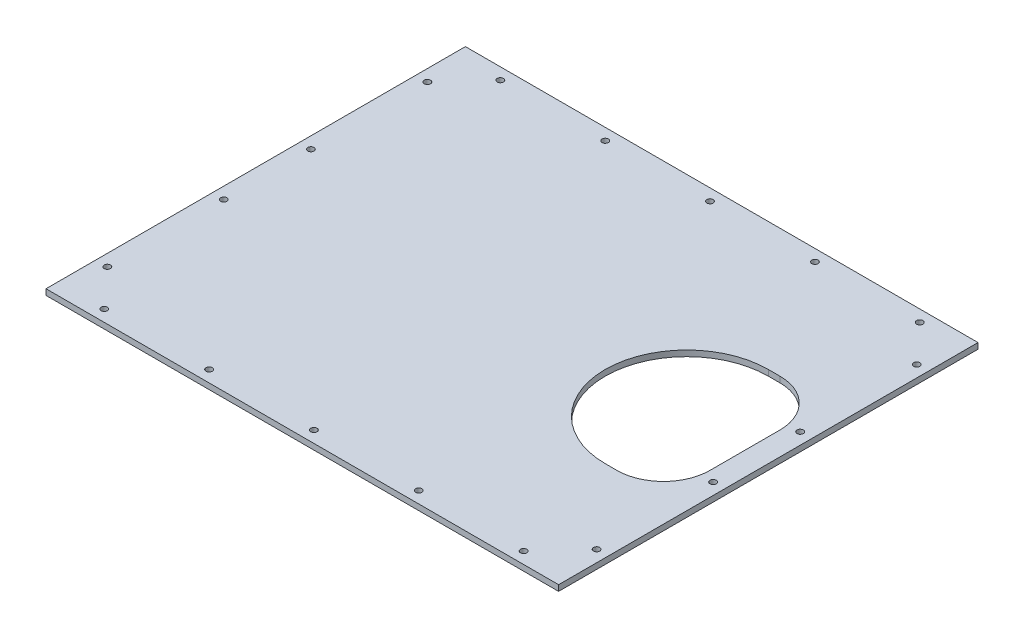
ISO-10303-21;
HEADER;
FILE_DESCRIPTION(('STEP AP214'),'2;1');
FILE_NAME('part.step','',(''),(''),'','','');
FILE_SCHEMA(('AUTOMOTIVE_DESIGN { 1 0 10303 214 1 1 1 1 }'));
ENDSEC;
DATA;
#1=APPLICATION_CONTEXT('core data for automotive mechanical design processes');
#2=APPLICATION_PROTOCOL_DEFINITION('international standard','automotive_design',2000,#1);
#3=PRODUCT_CONTEXT('',#1,'mechanical');
#4=PRODUCT('Part','Part','',(#3));
#5=PRODUCT_RELATED_PRODUCT_CATEGORY('part','',(#4));
#6=PRODUCT_DEFINITION_FORMATION('','',#4);
#7=PRODUCT_DEFINITION_CONTEXT('part definition',#1,'design');
#8=PRODUCT_DEFINITION('design','',#6,#7);
#9=PRODUCT_DEFINITION_SHAPE('','',#8);
#10=(LENGTH_UNIT() NAMED_UNIT(*) SI_UNIT(.MILLI.,.METRE.));
#11=(NAMED_UNIT(*) PLANE_ANGLE_UNIT() SI_UNIT($,.RADIAN.));
#12=(NAMED_UNIT(*) SI_UNIT($,.STERADIAN.) SOLID_ANGLE_UNIT());
#13=UNCERTAINTY_MEASURE_WITH_UNIT(LENGTH_MEASURE(1.E-05),#10,'distance_accuracy_value','');
#14=(GEOMETRIC_REPRESENTATION_CONTEXT(3) GLOBAL_UNCERTAINTY_ASSIGNED_CONTEXT((#13)) GLOBAL_UNIT_ASSIGNED_CONTEXT((#10,
#11,#12)) REPRESENTATION_CONTEXT('',''));
#15=CARTESIAN_POINT('',(0.,0.,0.));
#16=DIRECTION('',(0.,0.,1.));
#17=DIRECTION('',(1.,0.,0.));
#18=AXIS2_PLACEMENT_3D('',#15,#16,#17);
#19=CARTESIAN_POINT('',(0.,5.,0.));
#20=DIRECTION('',(0.,-1.,0.));
#21=DIRECTION('',(0.,0.,-1.));
#22=AXIS2_PLACEMENT_3D('',#19,#20,#21);
#23=PLANE('',#22);
#24=DIRECTION('',(0.,0.,1.));
#25=VECTOR('',#24,1.);
#26=CARTESIAN_POINT('',(0.,5.,0.));
#27=LINE('',#26,#25);
#28=CARTESIAN_POINT('',(0.,5.,-360.));
#29=VERTEX_POINT('',#28);
#30=CARTESIAN_POINT('',(0.,5.,0.));
#31=VERTEX_POINT('',#30);
#32=EDGE_CURVE('E418',#29,#31,#27,.T.);
#33=ORIENTED_EDGE('',*,*,#32,.T.);
#34=DIRECTION('',(1.,0.,0.));
#35=VECTOR('',#34,1.);
#36=CARTESIAN_POINT('',(0.,5.,0.));
#37=LINE('',#36,#35);
#38=CARTESIAN_POINT('',(440.,5.,0.));
#39=VERTEX_POINT('',#38);
#40=EDGE_CURVE('E456',#31,#39,#37,.T.);
#41=ORIENTED_EDGE('',*,*,#40,.T.);
#42=DIRECTION('',(0.,0.,-1.));
#43=VECTOR('',#42,1.);
#44=CARTESIAN_POINT('',(440.,5.,0.));
#45=LINE('',#44,#43);
#46=CARTESIAN_POINT('',(440.,5.,-360.));
#47=VERTEX_POINT('',#46);
#48=EDGE_CURVE('E431',#39,#47,#45,.T.);
#49=ORIENTED_EDGE('',*,*,#48,.T.);
#50=DIRECTION('',(-1.,0.,0.));
#51=VECTOR('',#50,1.);
#52=CARTESIAN_POINT('',(0.,5.,-360.));
#53=LINE('',#52,#51);
#54=EDGE_CURVE('E414',#47,#29,#53,.T.);
#55=ORIENTED_EDGE('',*,*,#54,.T.);
#56=EDGE_LOOP('',(#33,#41,#49,#55));
#57=FACE_BOUND('',#56,.T.);
#58=CARTESIAN_POINT('',(370.,5.,-180.));
#59=DIRECTION('',(0.,1.,0.));
#60=DIRECTION('',(0.,0.,1.));
#61=AXIS2_PLACEMENT_3D('',#58,#59,#60);
#62=CIRCLE('',#61,70.);
#63=CARTESIAN_POINT('',(370.,5.,-250.));
#64=VERTEX_POINT('',#63);
#65=CARTESIAN_POINT('',(370.,5.,-110.));
#66=VERTEX_POINT('',#65);
#67=EDGE_CURVE('E120',#64,#66,#62,.T.);
#68=ORIENTED_EDGE('',*,*,#67,.F.);
#69=DIRECTION('',(-1.,0.,0.));
#70=VECTOR('',#69,1.);
#71=CARTESIAN_POINT('',(370.,5.,-250.));
#72=LINE('',#71,#70);
#73=CARTESIAN_POINT('',(380.,5.,-250.));
#74=VERTEX_POINT('',#73);
#75=EDGE_CURVE('E153',#74,#64,#72,.T.);
#76=ORIENTED_EDGE('',*,*,#75,.F.);
#77=CARTESIAN_POINT('',(380.,5.,-210.));
#78=DIRECTION('',(0.,-1.,0.));
#79=DIRECTION('',(0.,0.,-1.));
#80=AXIS2_PLACEMENT_3D('',#77,#78,#79);
#81=CIRCLE('',#80,40.);
#82=CARTESIAN_POINT('',(420.,5.,-210.));
#83=VERTEX_POINT('',#82);
#84=EDGE_CURVE('E12',#74,#83,#81,.T.);
#85=ORIENTED_EDGE('',*,*,#84,.T.);
#86=DIRECTION('',(0.,0.,-1.));
#87=VECTOR('',#86,1.);
#88=CARTESIAN_POINT('',(420.,5.,-250.));
#89=LINE('',#88,#87);
#90=CARTESIAN_POINT('',(420.,5.,-150.));
#91=VERTEX_POINT('',#90);
#92=EDGE_CURVE('E149',#91,#83,#89,.T.);
#93=ORIENTED_EDGE('',*,*,#92,.F.);
#94=CARTESIAN_POINT('',(380.,5.,-150.));
#95=DIRECTION('',(0.,-1.,0.));
#96=DIRECTION('',(0.,0.,-1.));
#97=AXIS2_PLACEMENT_3D('',#94,#95,#96);
#98=CIRCLE('',#97,40.);
#99=CARTESIAN_POINT('',(380.,5.,-110.));
#100=VERTEX_POINT('',#99);
#101=EDGE_CURVE('E147',#91,#100,#98,.T.);
#102=ORIENTED_EDGE('',*,*,#101,.T.);
#103=DIRECTION('',(1.,0.,0.));
#104=VECTOR('',#103,1.);
#105=CARTESIAN_POINT('',(420.,5.,-110.));
#106=LINE('',#105,#104);
#107=EDGE_CURVE('E131',#66,#100,#106,.T.);
#108=ORIENTED_EDGE('',*,*,#107,.F.);
#109=EDGE_LOOP('',(#68,#76,#85,#93,#102,#108));
#110=FACE_BOUND('',#109,.T.);
#111=CARTESIAN_POINT('',(40.,5.,-350.));
#112=DIRECTION('',(0.,1.,0.));
#113=DIRECTION('',(0.,0.,1.));
#114=AXIS2_PLACEMENT_3D('',#111,#112,#113);
#115=CIRCLE('',#114,2.69999999999999);
#116=CARTESIAN_POINT('',(40.,5.,-347.3));
#117=VERTEX_POINT('',#116);
#118=EDGE_CURVE('E169',#117,#117,#115,.T.);
#119=ORIENTED_EDGE('',*,*,#118,.F.);
#120=EDGE_LOOP('',(#119));
#121=FACE_BOUND('',#120,.T.);
#122=CARTESIAN_POINT('',(400.,5.,-9.9999999999999));
#123=DIRECTION('',(0.,1.,0.));
#124=DIRECTION('',(0.,0.,-1.));
#125=AXIS2_PLACEMENT_3D('',#122,#123,#124);
#126=CIRCLE('',#125,2.70000000000001);
#127=CARTESIAN_POINT('',(400.,5.,-12.6999999999999));
#128=VERTEX_POINT('',#127);
#129=EDGE_CURVE('E179',#128,#128,#126,.T.);
#130=ORIENTED_EDGE('',*,*,#129,.F.);
#131=EDGE_LOOP('',(#130));
#132=FACE_BOUND('',#131,.T.);
#133=CARTESIAN_POINT('',(130.,5.,-350.));
#134=DIRECTION('',(0.,1.,0.));
#135=DIRECTION('',(0.,0.,1.));
#136=AXIS2_PLACEMENT_3D('',#133,#134,#135);
#137=CIRCLE('',#136,2.69999999999998);
#138=CARTESIAN_POINT('',(130.,5.,-347.3));
#139=VERTEX_POINT('',#138);
#140=EDGE_CURVE('E188',#139,#139,#137,.T.);
#141=ORIENTED_EDGE('',*,*,#140,.F.);
#142=EDGE_LOOP('',(#141));
#143=FACE_BOUND('',#142,.T.);
#144=CARTESIAN_POINT('',(220.,5.,-350.));
#145=DIRECTION('',(0.,1.,0.));
#146=DIRECTION('',(0.,0.,1.));
#147=AXIS2_PLACEMENT_3D('',#144,#145,#146);
#148=CIRCLE('',#147,2.69999999999998);
#149=CARTESIAN_POINT('',(220.,5.,-347.3));
#150=VERTEX_POINT('',#149);
#151=EDGE_CURVE('E195',#150,#150,#148,.T.);
#152=ORIENTED_EDGE('',*,*,#151,.F.);
#153=EDGE_LOOP('',(#152));
#154=FACE_BOUND('',#153,.T.);
#155=CARTESIAN_POINT('',(310.,5.,-350.));
#156=DIRECTION('',(0.,1.,0.));
#157=DIRECTION('',(0.,0.,1.));
#158=AXIS2_PLACEMENT_3D('',#155,#156,#157);
#159=CIRCLE('',#158,2.70000000000001);
#160=CARTESIAN_POINT('',(310.,5.,-347.3));
#161=VERTEX_POINT('',#160);
#162=EDGE_CURVE('E213',#161,#161,#159,.T.);
#163=ORIENTED_EDGE('',*,*,#162,.F.);
#164=EDGE_LOOP('',(#163));
#165=FACE_BOUND('',#164,.T.);
#166=CARTESIAN_POINT('',(400.,5.,-350.));
#167=DIRECTION('',(0.,1.,0.));
#168=DIRECTION('',(0.,0.,1.));
#169=AXIS2_PLACEMENT_3D('',#166,#167,#168);
#170=CIRCLE('',#169,2.70000000000001);
#171=CARTESIAN_POINT('',(400.,5.,-347.3));
#172=VERTEX_POINT('',#171);
#173=EDGE_CURVE('E214',#172,#172,#170,.T.);
#174=ORIENTED_EDGE('',*,*,#173,.F.);
#175=EDGE_LOOP('',(#174));
#176=FACE_BOUND('',#175,.T.);
#177=CARTESIAN_POINT('',(310.,5.,-9.9999999999999));
#178=DIRECTION('',(0.,1.,0.));
#179=DIRECTION('',(0.,0.,-1.));
#180=AXIS2_PLACEMENT_3D('',#177,#178,#179);
#181=CIRCLE('',#180,2.70000000000001);
#182=CARTESIAN_POINT('',(310.,5.,-12.6999999999999));
#183=VERTEX_POINT('',#182);
#184=EDGE_CURVE('E223',#183,#183,#181,.T.);
#185=ORIENTED_EDGE('',*,*,#184,.F.);
#186=EDGE_LOOP('',(#185));
#187=FACE_BOUND('',#186,.T.);
#188=CARTESIAN_POINT('',(220.,5.,-9.9999999999999));
#189=DIRECTION('',(0.,1.,0.));
#190=DIRECTION('',(0.,0.,-1.));
#191=AXIS2_PLACEMENT_3D('',#188,#189,#190);
#192=CIRCLE('',#191,2.69999999999998);
#193=CARTESIAN_POINT('',(220.,5.,-12.6999999999999));
#194=VERTEX_POINT('',#193);
#195=EDGE_CURVE('E241',#194,#194,#192,.T.);
#196=ORIENTED_EDGE('',*,*,#195,.F.);
#197=EDGE_LOOP('',(#196));
#198=FACE_BOUND('',#197,.T.);
#199=CARTESIAN_POINT('',(130.,5.,-9.9999999999999));
#200=DIRECTION('',(0.,1.,0.));
#201=DIRECTION('',(0.,0.,-1.));
#202=AXIS2_PLACEMENT_3D('',#199,#200,#201);
#203=CIRCLE('',#202,2.69999999999998);
#204=CARTESIAN_POINT('',(130.,5.,-12.6999999999999));
#205=VERTEX_POINT('',#204);
#206=EDGE_CURVE('E242',#205,#205,#203,.T.);
#207=ORIENTED_EDGE('',*,*,#206,.F.);
#208=EDGE_LOOP('',(#207));
#209=FACE_BOUND('',#208,.T.);
#210=CARTESIAN_POINT('',(40.,5.,-9.9999999999999));
#211=DIRECTION('',(0.,1.,0.));
#212=DIRECTION('',(0.,0.,-1.));
#213=AXIS2_PLACEMENT_3D('',#210,#211,#212);
#214=CIRCLE('',#213,2.69999999999999);
#215=CARTESIAN_POINT('',(40.,5.,-12.6999999999999));
#216=VERTEX_POINT('',#215);
#217=EDGE_CURVE('E251',#216,#216,#214,.T.);
#218=ORIENTED_EDGE('',*,*,#217,.F.);
#219=EDGE_LOOP('',(#218));
#220=FACE_BOUND('',#219,.T.);
#221=CARTESIAN_POINT('',(10.,5.,-217.367258669528));
#222=DIRECTION('',(0.,1.,0.));
#223=DIRECTION('',(0.,0.,1.));
#224=AXIS2_PLACEMENT_3D('',#221,#222,#223);
#225=CIRCLE('',#224,2.7);
#226=CARTESIAN_POINT('',(10.,5.,-214.667258669528));
#227=VERTEX_POINT('',#226);
#228=EDGE_CURVE('E269',#227,#227,#225,.T.);
#229=ORIENTED_EDGE('',*,*,#228,.F.);
#230=EDGE_LOOP('',(#229));
#231=FACE_BOUND('',#230,.T.);
#232=CARTESIAN_POINT('',(9.99999999999966,5.,-317.367258669528));
#233=DIRECTION('',(0.,1.,0.));
#234=DIRECTION('',(0.,0.,1.));
#235=AXIS2_PLACEMENT_3D('',#232,#233,#234);
#236=CIRCLE('',#235,2.69999999999999);
#237=CARTESIAN_POINT('',(9.99999999999966,5.,-314.667258669528));
#238=VERTEX_POINT('',#237);
#239=EDGE_CURVE('E270',#238,#238,#236,.T.);
#240=ORIENTED_EDGE('',*,*,#239,.F.);
#241=EDGE_LOOP('',(#240));
#242=FACE_BOUND('',#241,.T.);
#243=CARTESIAN_POINT('',(9.99999999999966,5.,-42.6327413304721));
#244=DIRECTION('',(0.,1.,0.));
#245=DIRECTION('',(0.,0.,-1.));
#246=AXIS2_PLACEMENT_3D('',#243,#244,#245);
#247=CIRCLE('',#246,2.69999999999999);
#248=CARTESIAN_POINT('',(9.99999999999966,5.,-45.3327413304721));
#249=VERTEX_POINT('',#248);
#250=EDGE_CURVE('E279',#249,#249,#247,.T.);
#251=ORIENTED_EDGE('',*,*,#250,.F.);
#252=EDGE_LOOP('',(#251));
#253=FACE_BOUND('',#252,.T.);
#254=CARTESIAN_POINT('',(10.,5.,-142.632741330472));
#255=DIRECTION('',(0.,1.,0.));
#256=DIRECTION('',(0.,0.,-1.));
#257=AXIS2_PLACEMENT_3D('',#254,#255,#256);
#258=CIRCLE('',#257,2.7);
#259=CARTESIAN_POINT('',(10.,5.,-145.332741330472));
#260=VERTEX_POINT('',#259);
#261=EDGE_CURVE('E297',#260,#260,#258,.T.);
#262=ORIENTED_EDGE('',*,*,#261,.F.);
#263=EDGE_LOOP('',(#262));
#264=FACE_BOUND('',#263,.T.);
#265=CARTESIAN_POINT('',(430.,5.,-142.632741330472));
#266=DIRECTION('',(0.,1.,0.));
#267=DIRECTION('',(0.,0.,1.));
#268=AXIS2_PLACEMENT_3D('',#265,#266,#267);
#269=CIRCLE('',#268,2.69999999999996);
#270=CARTESIAN_POINT('',(430.,5.,-139.932741330472));
#271=VERTEX_POINT('',#270);
#272=EDGE_CURVE('E298',#271,#271,#269,.T.);
#273=ORIENTED_EDGE('',*,*,#272,.F.);
#274=EDGE_LOOP('',(#273));
#275=FACE_BOUND('',#274,.T.);
#276=CARTESIAN_POINT('',(430.,5.,-42.6327413304723));
#277=DIRECTION('',(0.,1.,0.));
#278=DIRECTION('',(0.,0.,1.));
#279=AXIS2_PLACEMENT_3D('',#276,#277,#278);
#280=CIRCLE('',#279,2.70000000000006);
#281=CARTESIAN_POINT('',(430.,5.,-39.9327413304723));
#282=VERTEX_POINT('',#281);
#283=EDGE_CURVE('E307',#282,#282,#280,.T.);
#284=ORIENTED_EDGE('',*,*,#283,.F.);
#285=EDGE_LOOP('',(#284));
#286=FACE_BOUND('',#285,.T.);
#287=CARTESIAN_POINT('',(430.,5.,-317.367258669528));
#288=DIRECTION('',(0.,1.,0.));
#289=DIRECTION('',(0.,0.,-1.));
#290=AXIS2_PLACEMENT_3D('',#287,#288,#289);
#291=CIRCLE('',#290,2.70000000000006);
#292=CARTESIAN_POINT('',(430.,5.,-320.067258669528));
#293=VERTEX_POINT('',#292);
#294=EDGE_CURVE('E323',#293,#293,#291,.T.);
#295=ORIENTED_EDGE('',*,*,#294,.F.);
#296=EDGE_LOOP('',(#295));
#297=FACE_BOUND('',#296,.T.);
#298=CARTESIAN_POINT('',(430.,5.,-217.367258669528));
#299=DIRECTION('',(0.,1.,0.));
#300=DIRECTION('',(0.,0.,-1.));
#301=AXIS2_PLACEMENT_3D('',#298,#299,#300);
#302=CIRCLE('',#301,2.69999999999996);
#303=CARTESIAN_POINT('',(430.,5.,-220.067258669528));
#304=VERTEX_POINT('',#303);
#305=EDGE_CURVE('E324',#304,#304,#302,.T.);
#306=ORIENTED_EDGE('',*,*,#305,.F.);
#307=EDGE_LOOP('',(#306));
#308=FACE_BOUND('',#307,.T.);
#309=ADVANCED_FACE('F42',(#57,#110,#121,#132,#143,#154,#165,#176,#187,#198,#209,#220,#231,#242,
#253,#264,#275,#286,#297,#308),#23,.F.);
#310=CARTESIAN_POINT('',(0.,0.,0.));
#311=DIRECTION('',(0.,-1.,0.));
#312=DIRECTION('',(0.,0.,-1.));
#313=AXIS2_PLACEMENT_3D('',#310,#311,#312);
#314=PLANE('',#313);
#315=CARTESIAN_POINT('',(430.,0.,-317.367258669528));
#316=DIRECTION('',(0.,1.,0.));
#317=DIRECTION('',(0.,0.,-1.));
#318=AXIS2_PLACEMENT_3D('',#315,#316,#317);
#319=CIRCLE('',#318,2.70000000000006);
#320=CARTESIAN_POINT('',(430.,0.,-320.067258669528));
#321=VERTEX_POINT('',#320);
#322=EDGE_CURVE('E320',#321,#321,#319,.T.);
#323=ORIENTED_EDGE('',*,*,#322,.T.);
#324=EDGE_LOOP('',(#323));
#325=FACE_BOUND('',#324,.T.);
#326=CARTESIAN_POINT('',(430.,0.,-142.632741330472));
#327=DIRECTION('',(0.,1.,0.));
#328=DIRECTION('',(0.,0.,1.));
#329=AXIS2_PLACEMENT_3D('',#326,#327,#328);
#330=CIRCLE('',#329,2.69999999999996);
#331=CARTESIAN_POINT('',(430.,0.,-139.932741330472));
#332=VERTEX_POINT('',#331);
#333=EDGE_CURVE('E303',#332,#332,#330,.T.);
#334=ORIENTED_EDGE('',*,*,#333,.T.);
#335=EDGE_LOOP('',(#334));
#336=FACE_BOUND('',#335,.T.);
#337=CARTESIAN_POINT('',(9.99999999999966,0.,-42.6327413304721));
#338=DIRECTION('',(0.,1.,0.));
#339=DIRECTION('',(0.,0.,-1.));
#340=AXIS2_PLACEMENT_3D('',#337,#338,#339);
#341=CIRCLE('',#340,2.69999999999999);
#342=CARTESIAN_POINT('',(9.99999999999966,0.,-45.3327413304721));
#343=VERTEX_POINT('',#342);
#344=EDGE_CURVE('E284',#343,#343,#341,.T.);
#345=ORIENTED_EDGE('',*,*,#344,.T.);
#346=EDGE_LOOP('',(#345));
#347=FACE_BOUND('',#346,.T.);
#348=CARTESIAN_POINT('',(10.,0.,-217.367258669528));
#349=DIRECTION('',(0.,1.,0.));
#350=DIRECTION('',(0.,0.,1.));
#351=AXIS2_PLACEMENT_3D('',#348,#349,#350);
#352=CIRCLE('',#351,2.7);
#353=CARTESIAN_POINT('',(10.,0.,-214.667258669528));
#354=VERTEX_POINT('',#353);
#355=EDGE_CURVE('E266',#354,#354,#352,.T.);
#356=ORIENTED_EDGE('',*,*,#355,.T.);
#357=EDGE_LOOP('',(#356));
#358=FACE_BOUND('',#357,.T.);
#359=CARTESIAN_POINT('',(130.,0.,-9.9999999999999));
#360=DIRECTION('',(0.,1.,0.));
#361=DIRECTION('',(0.,0.,-1.));
#362=AXIS2_PLACEMENT_3D('',#359,#360,#361);
#363=CIRCLE('',#362,2.69999999999998);
#364=CARTESIAN_POINT('',(130.,0.,-12.6999999999999));
#365=VERTEX_POINT('',#364);
#366=EDGE_CURVE('E247',#365,#365,#363,.T.);
#367=ORIENTED_EDGE('',*,*,#366,.T.);
#368=EDGE_LOOP('',(#367));
#369=FACE_BOUND('',#368,.T.);
#370=CARTESIAN_POINT('',(310.,0.,-9.9999999999999));
#371=DIRECTION('',(0.,1.,0.));
#372=DIRECTION('',(0.,0.,-1.));
#373=AXIS2_PLACEMENT_3D('',#370,#371,#372);
#374=CIRCLE('',#373,2.70000000000001);
#375=CARTESIAN_POINT('',(310.,0.,-12.6999999999999));
#376=VERTEX_POINT('',#375);
#377=EDGE_CURVE('E228',#376,#376,#374,.T.);
#378=ORIENTED_EDGE('',*,*,#377,.T.);
#379=EDGE_LOOP('',(#378));
#380=FACE_BOUND('',#379,.T.);
#381=CARTESIAN_POINT('',(310.,0.,-350.));
#382=DIRECTION('',(0.,1.,0.));
#383=DIRECTION('',(0.,0.,1.));
#384=AXIS2_PLACEMENT_3D('',#381,#382,#383);
#385=CIRCLE('',#384,2.70000000000001);
#386=CARTESIAN_POINT('',(310.,0.,-347.3));
#387=VERTEX_POINT('',#386);
#388=EDGE_CURVE('E210',#387,#387,#385,.T.);
#389=ORIENTED_EDGE('',*,*,#388,.T.);
#390=EDGE_LOOP('',(#389));
#391=FACE_BOUND('',#390,.T.);
#392=CARTESIAN_POINT('',(130.,0.,-350.));
#393=DIRECTION('',(0.,1.,0.));
#394=DIRECTION('',(0.,0.,1.));
#395=AXIS2_PLACEMENT_3D('',#392,#393,#394);
#396=CIRCLE('',#395,2.69999999999998);
#397=CARTESIAN_POINT('',(130.,0.,-347.3));
#398=VERTEX_POINT('',#397);
#399=EDGE_CURVE('E191',#398,#398,#396,.T.);
#400=ORIENTED_EDGE('',*,*,#399,.T.);
#401=EDGE_LOOP('',(#400));
#402=FACE_BOUND('',#401,.T.);
#403=CARTESIAN_POINT('',(40.,0.,-350.));
#404=DIRECTION('',(0.,1.,0.));
#405=DIRECTION('',(0.,0.,1.));
#406=AXIS2_PLACEMENT_3D('',#403,#404,#405);
#407=CIRCLE('',#406,2.69999999999999);
#408=CARTESIAN_POINT('',(40.,0.,-347.3));
#409=VERTEX_POINT('',#408);
#410=EDGE_CURVE('E175',#409,#409,#407,.T.);
#411=ORIENTED_EDGE('',*,*,#410,.T.);
#412=EDGE_LOOP('',(#411));
#413=FACE_BOUND('',#412,.T.);
#414=DIRECTION('',(0.,0.,1.));
#415=VECTOR('',#414,1.);
#416=CARTESIAN_POINT('',(0.,0.,0.));
#417=LINE('',#416,#415);
#418=CARTESIAN_POINT('',(0.,0.,-360.));
#419=VERTEX_POINT('',#418);
#420=CARTESIAN_POINT('',(0.,0.,0.));
#421=VERTEX_POINT('',#420);
#422=EDGE_CURVE('E142',#419,#421,#417,.T.);
#423=ORIENTED_EDGE('',*,*,#422,.F.);
#424=DIRECTION('',(-1.,0.,0.));
#425=VECTOR('',#424,1.);
#426=CARTESIAN_POINT('',(0.,0.,-360.));
#427=LINE('',#426,#425);
#428=CARTESIAN_POINT('',(440.,0.,-360.));
#429=VERTEX_POINT('',#428);
#430=EDGE_CURVE('E415',#429,#419,#427,.T.);
#431=ORIENTED_EDGE('',*,*,#430,.F.);
#432=DIRECTION('',(0.,0.,-1.));
#433=VECTOR('',#432,1.);
#434=CARTESIAN_POINT('',(440.,0.,0.));
#435=LINE('',#434,#433);
#436=CARTESIAN_POINT('',(440.,0.,0.));
#437=VERTEX_POINT('',#436);
#438=EDGE_CURVE('E419',#437,#429,#435,.T.);
#439=ORIENTED_EDGE('',*,*,#438,.F.);
#440=DIRECTION('',(1.,0.,0.));
#441=VECTOR('',#440,1.);
#442=CARTESIAN_POINT('',(0.,0.,0.));
#443=LINE('',#442,#441);
#444=EDGE_CURVE('E422',#421,#437,#443,.T.);
#445=ORIENTED_EDGE('',*,*,#444,.F.);
#446=EDGE_LOOP('',(#423,#431,#439,#445));
#447=FACE_BOUND('',#446,.T.);
#448=DIRECTION('',(0.,0.,-1.));
#449=VECTOR('',#448,1.);
#450=CARTESIAN_POINT('',(420.,0.,-250.));
#451=LINE('',#450,#449);
#452=CARTESIAN_POINT('',(420.,0.,-150.));
#453=VERTEX_POINT('',#452);
#454=CARTESIAN_POINT('',(420.,0.,-210.));
#455=VERTEX_POINT('',#454);
#456=EDGE_CURVE('E447',#453,#455,#451,.T.);
#457=ORIENTED_EDGE('',*,*,#456,.T.);
#458=CARTESIAN_POINT('',(380.,0.,-210.));
#459=DIRECTION('',(0.,-1.,0.));
#460=DIRECTION('',(0.,0.,-1.));
#461=AXIS2_PLACEMENT_3D('',#458,#459,#460);
#462=CIRCLE('',#461,40.);
#463=CARTESIAN_POINT('',(380.,0.,-250.));
#464=VERTEX_POINT('',#463);
#465=EDGE_CURVE('E52',#455,#464,#462,.F.);
#466=ORIENTED_EDGE('',*,*,#465,.T.);
#467=DIRECTION('',(-1.,0.,0.));
#468=VECTOR('',#467,1.);
#469=CARTESIAN_POINT('',(370.,0.,-250.));
#470=LINE('',#469,#468);
#471=CARTESIAN_POINT('',(370.,0.,-250.));
#472=VERTEX_POINT('',#471);
#473=EDGE_CURVE('E132',#464,#472,#470,.T.);
#474=ORIENTED_EDGE('',*,*,#473,.T.);
#475=CARTESIAN_POINT('',(370.,0.,-180.));
#476=DIRECTION('',(0.,1.,0.));
#477=DIRECTION('',(0.,0.,1.));
#478=AXIS2_PLACEMENT_3D('',#475,#476,#477);
#479=CIRCLE('',#478,70.);
#480=CARTESIAN_POINT('',(370.,0.,-110.));
#481=VERTEX_POINT('',#480);
#482=EDGE_CURVE('E174',#472,#481,#479,.T.);
#483=ORIENTED_EDGE('',*,*,#482,.T.);
#484=DIRECTION('',(1.,0.,0.));
#485=VECTOR('',#484,1.);
#486=CARTESIAN_POINT('',(420.,0.,-110.));
#487=LINE('',#486,#485);
#488=CARTESIAN_POINT('',(380.,0.,-110.));
#489=VERTEX_POINT('',#488);
#490=EDGE_CURVE('E140',#481,#489,#487,.T.);
#491=ORIENTED_EDGE('',*,*,#490,.T.);
#492=CARTESIAN_POINT('',(380.,0.,-150.));
#493=DIRECTION('',(0.,-1.,0.));
#494=DIRECTION('',(0.,0.,-1.));
#495=AXIS2_PLACEMENT_3D('',#492,#493,#494);
#496=CIRCLE('',#495,40.);
#497=EDGE_CURVE('E382',#489,#453,#496,.F.);
#498=ORIENTED_EDGE('',*,*,#497,.T.);
#499=EDGE_LOOP('',(#457,#466,#474,#483,#491,#498));
#500=FACE_BOUND('',#499,.T.);
#501=CARTESIAN_POINT('',(400.,0.,-9.9999999999999));
#502=DIRECTION('',(0.,1.,0.));
#503=DIRECTION('',(0.,0.,-1.));
#504=AXIS2_PLACEMENT_3D('',#501,#502,#503);
#505=CIRCLE('',#504,2.70000000000001);
#506=CARTESIAN_POINT('',(400.,0.,-12.6999999999999));
#507=VERTEX_POINT('',#506);
#508=EDGE_CURVE('E176',#507,#507,#505,.T.);
#509=ORIENTED_EDGE('',*,*,#508,.T.);
#510=EDGE_LOOP('',(#509));
#511=FACE_BOUND('',#510,.T.);
#512=CARTESIAN_POINT('',(220.,0.,-350.));
#513=DIRECTION('',(0.,1.,0.));
#514=DIRECTION('',(0.,0.,1.));
#515=AXIS2_PLACEMENT_3D('',#512,#513,#514);
#516=CIRCLE('',#515,2.69999999999998);
#517=CARTESIAN_POINT('',(220.,0.,-347.3));
#518=VERTEX_POINT('',#517);
#519=EDGE_CURVE('E200',#518,#518,#516,.T.);
#520=ORIENTED_EDGE('',*,*,#519,.T.);
#521=EDGE_LOOP('',(#520));
#522=FACE_BOUND('',#521,.T.);
#523=CARTESIAN_POINT('',(400.,0.,-350.));
#524=DIRECTION('',(0.,1.,0.));
#525=DIRECTION('',(0.,0.,1.));
#526=AXIS2_PLACEMENT_3D('',#523,#524,#525);
#527=CIRCLE('',#526,2.70000000000001);
#528=CARTESIAN_POINT('',(400.,0.,-347.3));
#529=VERTEX_POINT('',#528);
#530=EDGE_CURVE('E219',#529,#529,#527,.T.);
#531=ORIENTED_EDGE('',*,*,#530,.T.);
#532=EDGE_LOOP('',(#531));
#533=FACE_BOUND('',#532,.T.);
#534=CARTESIAN_POINT('',(220.,0.,-9.9999999999999));
#535=DIRECTION('',(0.,1.,0.));
#536=DIRECTION('',(0.,0.,-1.));
#537=AXIS2_PLACEMENT_3D('',#534,#535,#536);
#538=CIRCLE('',#537,2.69999999999998);
#539=CARTESIAN_POINT('',(220.,0.,-12.6999999999999));
#540=VERTEX_POINT('',#539);
#541=EDGE_CURVE('E238',#540,#540,#538,.T.);
#542=ORIENTED_EDGE('',*,*,#541,.T.);
#543=EDGE_LOOP('',(#542));
#544=FACE_BOUND('',#543,.T.);
#545=CARTESIAN_POINT('',(40.,0.,-9.9999999999999));
#546=DIRECTION('',(0.,1.,0.));
#547=DIRECTION('',(0.,0.,-1.));
#548=AXIS2_PLACEMENT_3D('',#545,#546,#547);
#549=CIRCLE('',#548,2.69999999999999);
#550=CARTESIAN_POINT('',(40.,0.,-12.6999999999999));
#551=VERTEX_POINT('',#550);
#552=EDGE_CURVE('E256',#551,#551,#549,.T.);
#553=ORIENTED_EDGE('',*,*,#552,.T.);
#554=EDGE_LOOP('',(#553));
#555=FACE_BOUND('',#554,.T.);
#556=CARTESIAN_POINT('',(9.99999999999966,0.,-317.367258669528));
#557=DIRECTION('',(0.,1.,0.));
#558=DIRECTION('',(0.,0.,1.));
#559=AXIS2_PLACEMENT_3D('',#556,#557,#558);
#560=CIRCLE('',#559,2.69999999999999);
#561=CARTESIAN_POINT('',(9.99999999999966,0.,-314.667258669528));
#562=VERTEX_POINT('',#561);
#563=EDGE_CURVE('E275',#562,#562,#560,.T.);
#564=ORIENTED_EDGE('',*,*,#563,.T.);
#565=EDGE_LOOP('',(#564));
#566=FACE_BOUND('',#565,.T.);
#567=CARTESIAN_POINT('',(10.,0.,-142.632741330472));
#568=DIRECTION('',(0.,1.,0.));
#569=DIRECTION('',(0.,0.,-1.));
#570=AXIS2_PLACEMENT_3D('',#567,#568,#569);
#571=CIRCLE('',#570,2.7);
#572=CARTESIAN_POINT('',(10.,0.,-145.332741330472));
#573=VERTEX_POINT('',#572);
#574=EDGE_CURVE('E294',#573,#573,#571,.T.);
#575=ORIENTED_EDGE('',*,*,#574,.T.);
#576=EDGE_LOOP('',(#575));
#577=FACE_BOUND('',#576,.T.);
#578=CARTESIAN_POINT('',(430.,0.,-42.6327413304723));
#579=DIRECTION('',(0.,1.,0.));
#580=DIRECTION('',(0.,0.,1.));
#581=AXIS2_PLACEMENT_3D('',#578,#579,#580);
#582=CIRCLE('',#581,2.70000000000006);
#583=CARTESIAN_POINT('',(430.,0.,-39.9327413304723));
#584=VERTEX_POINT('',#583);
#585=EDGE_CURVE('E312',#584,#584,#582,.T.);
#586=ORIENTED_EDGE('',*,*,#585,.T.);
#587=EDGE_LOOP('',(#586));
#588=FACE_BOUND('',#587,.T.);
#589=CARTESIAN_POINT('',(430.,0.,-217.367258669528));
#590=DIRECTION('',(0.,1.,0.));
#591=DIRECTION('',(0.,0.,-1.));
#592=AXIS2_PLACEMENT_3D('',#589,#590,#591);
#593=CIRCLE('',#592,2.69999999999996);
#594=CARTESIAN_POINT('',(430.,0.,-220.067258669528));
#595=VERTEX_POINT('',#594);
#596=EDGE_CURVE('E329',#595,#595,#593,.T.);
#597=ORIENTED_EDGE('',*,*,#596,.T.);
#598=EDGE_LOOP('',(#597));
#599=FACE_BOUND('',#598,.T.);
#600=ADVANCED_FACE('F341',(#325,#336,#347,#358,#369,#380,#391,#402,#413,#447,#500,#511,#522,
#533,#544,#555,#566,#577,#588,#599),#314,.T.);
#601=CARTESIAN_POINT('',(0.,5.,0.));
#602=DIRECTION('',(1.,0.,0.));
#603=DIRECTION('',(0.,0.,-1.));
#604=AXIS2_PLACEMENT_3D('',#601,#602,#603);
#605=PLANE('',#604);
#606=ORIENTED_EDGE('',*,*,#422,.T.);
#607=DIRECTION('',(0.,-1.,0.));
#608=VECTOR('',#607,1.);
#609=CARTESIAN_POINT('',(0.,5.,0.));
#610=LINE('',#609,#608);
#611=EDGE_CURVE('E398',#31,#421,#610,.T.);
#612=ORIENTED_EDGE('',*,*,#611,.F.);
#613=ORIENTED_EDGE('',*,*,#32,.F.);
#614=DIRECTION('',(0.,-1.,0.));
#615=VECTOR('',#614,1.);
#616=CARTESIAN_POINT('',(0.,5.,-360.));
#617=LINE('',#616,#615);
#618=EDGE_CURVE('E410',#29,#419,#617,.T.);
#619=ORIENTED_EDGE('',*,*,#618,.T.);
#620=EDGE_LOOP('',(#606,#612,#613,#619));
#621=FACE_BOUND('',#620,.T.);
#622=ADVANCED_FACE('F347',(#621),#605,.F.);
#623=CARTESIAN_POINT('',(0.,5.,0.));
#624=DIRECTION('',(0.,0.,-1.));
#625=DIRECTION('',(-1.,0.,0.));
#626=AXIS2_PLACEMENT_3D('',#623,#624,#625);
#627=PLANE('',#626);
#628=ORIENTED_EDGE('',*,*,#444,.T.);
#629=DIRECTION('',(0.,-1.,0.));
#630=VECTOR('',#629,1.);
#631=CARTESIAN_POINT('',(440.,5.,0.));
#632=LINE('',#631,#630);
#633=EDGE_CURVE('E402',#39,#437,#632,.T.);
#634=ORIENTED_EDGE('',*,*,#633,.F.);
#635=ORIENTED_EDGE('',*,*,#40,.F.);
#636=ORIENTED_EDGE('',*,*,#611,.T.);
#637=EDGE_LOOP('',(#628,#634,#635,#636));
#638=FACE_BOUND('',#637,.T.);
#639=ADVANCED_FACE('F361',(#638),#627,.F.);
#640=CARTESIAN_POINT('',(440.,5.,0.));
#641=DIRECTION('',(-1.,0.,0.));
#642=DIRECTION('',(0.,0.,1.));
#643=AXIS2_PLACEMENT_3D('',#640,#641,#642);
#644=PLANE('',#643);
#645=ORIENTED_EDGE('',*,*,#438,.T.);
#646=DIRECTION('',(0.,-1.,0.));
#647=VECTOR('',#646,1.);
#648=CARTESIAN_POINT('',(440.,5.,-360.));
#649=LINE('',#648,#647);
#650=EDGE_CURVE('E406',#47,#429,#649,.T.);
#651=ORIENTED_EDGE('',*,*,#650,.F.);
#652=ORIENTED_EDGE('',*,*,#48,.F.);
#653=ORIENTED_EDGE('',*,*,#633,.T.);
#654=EDGE_LOOP('',(#645,#651,#652,#653));
#655=FACE_BOUND('',#654,.T.);
#656=ADVANCED_FACE('F357',(#655),#644,.F.);
#657=CARTESIAN_POINT('',(0.,5.,-360.));
#658=DIRECTION('',(0.,0.,1.));
#659=DIRECTION('',(1.,0.,0.));
#660=AXIS2_PLACEMENT_3D('',#657,#658,#659);
#661=PLANE('',#660);
#662=ORIENTED_EDGE('',*,*,#430,.T.);
#663=ORIENTED_EDGE('',*,*,#618,.F.);
#664=ORIENTED_EDGE('',*,*,#54,.F.);
#665=ORIENTED_EDGE('',*,*,#650,.T.);
#666=EDGE_LOOP('',(#662,#663,#664,#665));
#667=FACE_BOUND('',#666,.T.);
#668=ADVANCED_FACE('F354',(#667),#661,.F.);
#669=CARTESIAN_POINT('',(370.,5.,-180.));
#670=DIRECTION('',(0.,-1.,0.));
#671=DIRECTION('',(0.,0.,-1.));
#672=AXIS2_PLACEMENT_3D('',#669,#670,#671);
#673=CYLINDRICAL_SURFACE('',#672,70.);
#674=ORIENTED_EDGE('',*,*,#482,.F.);
#675=DIRECTION('',(0.,-1.,0.));
#676=VECTOR('',#675,1.);
#677=CARTESIAN_POINT('',(370.,5.,-250.));
#678=LINE('',#677,#676);
#679=EDGE_CURVE('E127',#64,#472,#678,.T.);
#680=ORIENTED_EDGE('',*,*,#679,.F.);
#681=ORIENTED_EDGE('',*,*,#67,.T.);
#682=DIRECTION('',(0.,-1.,0.));
#683=VECTOR('',#682,1.);
#684=CARTESIAN_POINT('',(370.,5.,-110.));
#685=LINE('',#684,#683);
#686=EDGE_CURVE('E124',#66,#481,#685,.T.);
#687=ORIENTED_EDGE('',*,*,#686,.T.);
#688=EDGE_LOOP('',(#674,#680,#681,#687));
#689=FACE_BOUND('',#688,.T.);
#690=ADVANCED_FACE('F123',(#689),#673,.F.);
#691=CARTESIAN_POINT('',(420.,5.,-110.));
#692=DIRECTION('',(0.,0.,-1.));
#693=DIRECTION('',(-1.,0.,0.));
#694=AXIS2_PLACEMENT_3D('',#691,#692,#693);
#695=PLANE('',#694);
#696=ORIENTED_EDGE('',*,*,#107,.T.);
#697=DIRECTION('',(0.,-1.,0.));
#698=VECTOR('',#697,1.);
#699=CARTESIAN_POINT('',(380.,0.,-110.));
#700=LINE('',#699,#698);
#701=EDGE_CURVE('E380',#100,#489,#700,.T.);
#702=ORIENTED_EDGE('',*,*,#701,.T.);
#703=ORIENTED_EDGE('',*,*,#490,.F.);
#704=ORIENTED_EDGE('',*,*,#686,.F.);
#705=EDGE_LOOP('',(#696,#702,#703,#704));
#706=FACE_BOUND('',#705,.T.);
#707=ADVANCED_FACE('F136',(#706),#695,.T.);
#708=CARTESIAN_POINT('',(420.,5.,-250.));
#709=DIRECTION('',(-1.,0.,0.));
#710=DIRECTION('',(0.,0.,1.));
#711=AXIS2_PLACEMENT_3D('',#708,#709,#710);
#712=PLANE('',#711);
#713=ORIENTED_EDGE('',*,*,#456,.F.);
#714=DIRECTION('',(0.,-1.,0.));
#715=VECTOR('',#714,1.);
#716=CARTESIAN_POINT('',(420.,5.,-150.));
#717=LINE('',#716,#715);
#718=EDGE_CURVE('E379',#453,#91,#717,.F.);
#719=ORIENTED_EDGE('',*,*,#718,.T.);
#720=ORIENTED_EDGE('',*,*,#92,.T.);
#721=DIRECTION('',(0.,-1.,0.));
#722=VECTOR('',#721,1.);
#723=CARTESIAN_POINT('',(420.,0.,-210.));
#724=LINE('',#723,#722);
#725=EDGE_CURVE('E392',#83,#455,#724,.T.);
#726=ORIENTED_EDGE('',*,*,#725,.T.);
#727=EDGE_LOOP('',(#713,#719,#720,#726));
#728=FACE_BOUND('',#727,.T.);
#729=ADVANCED_FACE('F545',(#728),#712,.T.);
#730=CARTESIAN_POINT('',(370.,5.,-250.));
#731=DIRECTION('',(0.,0.,1.));
#732=DIRECTION('',(1.,0.,0.));
#733=AXIS2_PLACEMENT_3D('',#730,#731,#732);
#734=PLANE('',#733);
#735=ORIENTED_EDGE('',*,*,#473,.F.);
#736=DIRECTION('',(0.,-1.,0.));
#737=VECTOR('',#736,1.);
#738=CARTESIAN_POINT('',(380.,5.,-250.));
#739=LINE('',#738,#737);
#740=EDGE_CURVE('E59',#464,#74,#739,.F.);
#741=ORIENTED_EDGE('',*,*,#740,.T.);
#742=ORIENTED_EDGE('',*,*,#75,.T.);
#743=ORIENTED_EDGE('',*,*,#679,.T.);
#744=EDGE_LOOP('',(#735,#741,#742,#743));
#745=FACE_BOUND('',#744,.T.);
#746=ADVANCED_FACE('F541',(#745),#734,.T.);
#747=CARTESIAN_POINT('',(40.,5.,-350.));
#748=DIRECTION('',(0.,-1.,0.));
#749=DIRECTION('',(0.,0.,-1.));
#750=AXIS2_PLACEMENT_3D('',#747,#748,#749);
#751=CYLINDRICAL_SURFACE('',#750,2.69999999999999);
#752=ORIENTED_EDGE('',*,*,#118,.T.);
#753=EDGE_LOOP('',(#752));
#754=FACE_BOUND('',#753,.T.);
#755=ORIENTED_EDGE('',*,*,#410,.F.);
#756=EDGE_LOOP('',(#755));
#757=FACE_BOUND('',#756,.T.);
#758=ADVANCED_FACE('F538',(#754,#757),#751,.F.);
#759=CARTESIAN_POINT('',(400.,5.,-9.9999999999999));
#760=DIRECTION('',(0.,-1.,0.));
#761=DIRECTION('',(0.,0.,-1.));
#762=AXIS2_PLACEMENT_3D('',#759,#760,#761);
#763=CYLINDRICAL_SURFACE('',#762,2.70000000000001);
#764=ORIENTED_EDGE('',*,*,#129,.T.);
#765=EDGE_LOOP('',(#764));
#766=FACE_BOUND('',#765,.T.);
#767=ORIENTED_EDGE('',*,*,#508,.F.);
#768=EDGE_LOOP('',(#767));
#769=FACE_BOUND('',#768,.T.);
#770=ADVANCED_FACE('F534',(#766,#769),#763,.F.);
#771=CARTESIAN_POINT('',(130.,5.,-350.));
#772=DIRECTION('',(0.,-1.,0.));
#773=DIRECTION('',(0.,0.,-1.));
#774=AXIS2_PLACEMENT_3D('',#771,#772,#773);
#775=CYLINDRICAL_SURFACE('',#774,2.69999999999998);
#776=ORIENTED_EDGE('',*,*,#140,.T.);
#777=EDGE_LOOP('',(#776));
#778=FACE_BOUND('',#777,.T.);
#779=ORIENTED_EDGE('',*,*,#399,.F.);
#780=EDGE_LOOP('',(#779));
#781=FACE_BOUND('',#780,.T.);
#782=ADVANCED_FACE('F530',(#778,#781),#775,.F.);
#783=CARTESIAN_POINT('',(220.,5.,-350.));
#784=DIRECTION('',(0.,-1.,0.));
#785=DIRECTION('',(0.,0.,-1.));
#786=AXIS2_PLACEMENT_3D('',#783,#784,#785);
#787=CYLINDRICAL_SURFACE('',#786,2.69999999999998);
#788=ORIENTED_EDGE('',*,*,#151,.T.);
#789=EDGE_LOOP('',(#788));
#790=FACE_BOUND('',#789,.T.);
#791=ORIENTED_EDGE('',*,*,#519,.F.);
#792=EDGE_LOOP('',(#791));
#793=FACE_BOUND('',#792,.T.);
#794=ADVANCED_FACE('F526',(#790,#793),#787,.F.);
#795=CARTESIAN_POINT('',(310.,5.,-350.));
#796=DIRECTION('',(0.,-1.,0.));
#797=DIRECTION('',(0.,0.,-1.));
#798=AXIS2_PLACEMENT_3D('',#795,#796,#797);
#799=CYLINDRICAL_SURFACE('',#798,2.70000000000001);
#800=ORIENTED_EDGE('',*,*,#162,.T.);
#801=EDGE_LOOP('',(#800));
#802=FACE_BOUND('',#801,.T.);
#803=ORIENTED_EDGE('',*,*,#388,.F.);
#804=EDGE_LOOP('',(#803));
#805=FACE_BOUND('',#804,.T.);
#806=ADVANCED_FACE('F519',(#802,#805),#799,.F.);
#807=CARTESIAN_POINT('',(400.,5.,-350.));
#808=DIRECTION('',(0.,-1.,0.));
#809=DIRECTION('',(0.,0.,-1.));
#810=AXIS2_PLACEMENT_3D('',#807,#808,#809);
#811=CYLINDRICAL_SURFACE('',#810,2.70000000000001);
#812=ORIENTED_EDGE('',*,*,#173,.T.);
#813=EDGE_LOOP('',(#812));
#814=FACE_BOUND('',#813,.T.);
#815=ORIENTED_EDGE('',*,*,#530,.F.);
#816=EDGE_LOOP('',(#815));
#817=FACE_BOUND('',#816,.T.);
#818=ADVANCED_FACE('F509',(#814,#817),#811,.F.);
#819=CARTESIAN_POINT('',(310.,5.,-9.9999999999999));
#820=DIRECTION('',(0.,-1.,0.));
#821=DIRECTION('',(0.,0.,-1.));
#822=AXIS2_PLACEMENT_3D('',#819,#820,#821);
#823=CYLINDRICAL_SURFACE('',#822,2.70000000000001);
#824=ORIENTED_EDGE('',*,*,#184,.T.);
#825=EDGE_LOOP('',(#824));
#826=FACE_BOUND('',#825,.T.);
#827=ORIENTED_EDGE('',*,*,#377,.F.);
#828=EDGE_LOOP('',(#827));
#829=FACE_BOUND('',#828,.T.);
#830=ADVANCED_FACE('F506',(#826,#829),#823,.F.);
#831=CARTESIAN_POINT('',(220.,5.,-9.9999999999999));
#832=DIRECTION('',(0.,-1.,0.));
#833=DIRECTION('',(0.,0.,-1.));
#834=AXIS2_PLACEMENT_3D('',#831,#832,#833);
#835=CYLINDRICAL_SURFACE('',#834,2.69999999999998);
#836=ORIENTED_EDGE('',*,*,#195,.T.);
#837=EDGE_LOOP('',(#836));
#838=FACE_BOUND('',#837,.T.);
#839=ORIENTED_EDGE('',*,*,#541,.F.);
#840=EDGE_LOOP('',(#839));
#841=FACE_BOUND('',#840,.T.);
#842=ADVANCED_FACE('F508',(#838,#841),#835,.F.);
#843=CARTESIAN_POINT('',(130.,5.,-9.9999999999999));
#844=DIRECTION('',(0.,-1.,0.));
#845=DIRECTION('',(0.,0.,-1.));
#846=AXIS2_PLACEMENT_3D('',#843,#844,#845);
#847=CYLINDRICAL_SURFACE('',#846,2.69999999999998);
#848=ORIENTED_EDGE('',*,*,#206,.T.);
#849=EDGE_LOOP('',(#848));
#850=FACE_BOUND('',#849,.T.);
#851=ORIENTED_EDGE('',*,*,#366,.F.);
#852=EDGE_LOOP('',(#851));
#853=FACE_BOUND('',#852,.T.);
#854=ADVANCED_FACE('F516',(#850,#853),#847,.F.);
#855=CARTESIAN_POINT('',(40.,5.,-9.9999999999999));
#856=DIRECTION('',(0.,-1.,0.));
#857=DIRECTION('',(0.,0.,-1.));
#858=AXIS2_PLACEMENT_3D('',#855,#856,#857);
#859=CYLINDRICAL_SURFACE('',#858,2.69999999999999);
#860=ORIENTED_EDGE('',*,*,#217,.T.);
#861=EDGE_LOOP('',(#860));
#862=FACE_BOUND('',#861,.T.);
#863=ORIENTED_EDGE('',*,*,#552,.F.);
#864=EDGE_LOOP('',(#863));
#865=FACE_BOUND('',#864,.T.);
#866=ADVANCED_FACE('F673',(#862,#865),#859,.F.);
#867=CARTESIAN_POINT('',(10.,5.,-217.367258669528));
#868=DIRECTION('',(0.,-1.,0.));
#869=DIRECTION('',(0.,0.,-1.));
#870=AXIS2_PLACEMENT_3D('',#867,#868,#869);
#871=CYLINDRICAL_SURFACE('',#870,2.7);
#872=ORIENTED_EDGE('',*,*,#228,.T.);
#873=EDGE_LOOP('',(#872));
#874=FACE_BOUND('',#873,.T.);
#875=ORIENTED_EDGE('',*,*,#355,.F.);
#876=EDGE_LOOP('',(#875));
#877=FACE_BOUND('',#876,.T.);
#878=ADVANCED_FACE('F664',(#874,#877),#871,.F.);
#879=CARTESIAN_POINT('',(9.99999999999966,5.,-317.367258669528));
#880=DIRECTION('',(0.,-1.,0.));
#881=DIRECTION('',(0.,0.,-1.));
#882=AXIS2_PLACEMENT_3D('',#879,#880,#881);
#883=CYLINDRICAL_SURFACE('',#882,2.69999999999999);
#884=ORIENTED_EDGE('',*,*,#239,.T.);
#885=EDGE_LOOP('',(#884));
#886=FACE_BOUND('',#885,.T.);
#887=ORIENTED_EDGE('',*,*,#563,.F.);
#888=EDGE_LOOP('',(#887));
#889=FACE_BOUND('',#888,.T.);
#890=ADVANCED_FACE('F655',(#886,#889),#883,.F.);
#891=CARTESIAN_POINT('',(9.99999999999966,5.,-42.6327413304721));
#892=DIRECTION('',(0.,-1.,0.));
#893=DIRECTION('',(0.,0.,-1.));
#894=AXIS2_PLACEMENT_3D('',#891,#892,#893);
#895=CYLINDRICAL_SURFACE('',#894,2.69999999999999);
#896=ORIENTED_EDGE('',*,*,#250,.T.);
#897=EDGE_LOOP('',(#896));
#898=FACE_BOUND('',#897,.T.);
#899=ORIENTED_EDGE('',*,*,#344,.F.);
#900=EDGE_LOOP('',(#899));
#901=FACE_BOUND('',#900,.T.);
#902=ADVANCED_FACE('F646',(#898,#901),#895,.F.);
#903=CARTESIAN_POINT('',(10.,5.,-142.632741330472));
#904=DIRECTION('',(0.,-1.,0.));
#905=DIRECTION('',(0.,0.,-1.));
#906=AXIS2_PLACEMENT_3D('',#903,#904,#905);
#907=CYLINDRICAL_SURFACE('',#906,2.7);
#908=ORIENTED_EDGE('',*,*,#261,.T.);
#909=EDGE_LOOP('',(#908));
#910=FACE_BOUND('',#909,.T.);
#911=ORIENTED_EDGE('',*,*,#574,.F.);
#912=EDGE_LOOP('',(#911));
#913=FACE_BOUND('',#912,.T.);
#914=ADVANCED_FACE('F637',(#910,#913),#907,.F.);
#915=CARTESIAN_POINT('',(430.,5.,-142.632741330472));
#916=DIRECTION('',(0.,-1.,0.));
#917=DIRECTION('',(0.,0.,-1.));
#918=AXIS2_PLACEMENT_3D('',#915,#916,#917);
#919=CYLINDRICAL_SURFACE('',#918,2.69999999999996);
#920=ORIENTED_EDGE('',*,*,#272,.T.);
#921=EDGE_LOOP('',(#920));
#922=FACE_BOUND('',#921,.T.);
#923=ORIENTED_EDGE('',*,*,#333,.F.);
#924=EDGE_LOOP('',(#923));
#925=FACE_BOUND('',#924,.T.);
#926=ADVANCED_FACE('F628',(#922,#925),#919,.F.);
#927=CARTESIAN_POINT('',(430.,5.,-42.6327413304723));
#928=DIRECTION('',(0.,-1.,0.));
#929=DIRECTION('',(0.,0.,-1.));
#930=AXIS2_PLACEMENT_3D('',#927,#928,#929);
#931=CYLINDRICAL_SURFACE('',#930,2.70000000000006);
#932=ORIENTED_EDGE('',*,*,#283,.T.);
#933=EDGE_LOOP('',(#932));
#934=FACE_BOUND('',#933,.T.);
#935=ORIENTED_EDGE('',*,*,#585,.F.);
#936=EDGE_LOOP('',(#935));
#937=FACE_BOUND('',#936,.T.);
#938=ADVANCED_FACE('F619',(#934,#937),#931,.F.);
#939=CARTESIAN_POINT('',(430.,5.,-317.367258669528));
#940=DIRECTION('',(0.,-1.,0.));
#941=DIRECTION('',(0.,0.,-1.));
#942=AXIS2_PLACEMENT_3D('',#939,#940,#941);
#943=CYLINDRICAL_SURFACE('',#942,2.70000000000006);
#944=ORIENTED_EDGE('',*,*,#294,.T.);
#945=EDGE_LOOP('',(#944));
#946=FACE_BOUND('',#945,.T.);
#947=ORIENTED_EDGE('',*,*,#322,.F.);
#948=EDGE_LOOP('',(#947));
#949=FACE_BOUND('',#948,.T.);
#950=ADVANCED_FACE('F376',(#946,#949),#943,.F.);
#951=CARTESIAN_POINT('',(430.,5.,-217.367258669528));
#952=DIRECTION('',(0.,-1.,0.));
#953=DIRECTION('',(0.,0.,-1.));
#954=AXIS2_PLACEMENT_3D('',#951,#952,#953);
#955=CYLINDRICAL_SURFACE('',#954,2.69999999999996);
#956=ORIENTED_EDGE('',*,*,#305,.T.);
#957=EDGE_LOOP('',(#956));
#958=FACE_BOUND('',#957,.T.);
#959=ORIENTED_EDGE('',*,*,#596,.F.);
#960=EDGE_LOOP('',(#959));
#961=FACE_BOUND('',#960,.T.);
#962=ADVANCED_FACE('F337',(#958,#961),#955,.F.);
#963=CARTESIAN_POINT('',(380.,5.,-150.));
#964=DIRECTION('',(0.,1.,0.));
#965=DIRECTION('',(0.,0.,1.));
#966=AXIS2_PLACEMENT_3D('',#963,#964,#965);
#967=CYLINDRICAL_SURFACE('',#966,40.);
#968=ORIENTED_EDGE('',*,*,#101,.F.);
#969=ORIENTED_EDGE('',*,*,#718,.F.);
#970=ORIENTED_EDGE('',*,*,#497,.F.);
#971=ORIENTED_EDGE('',*,*,#701,.F.);
#972=EDGE_LOOP('',(#968,#969,#970,#971));
#973=FACE_BOUND('',#972,.T.);
#974=ADVANCED_FACE('F368',(#973),#967,.F.);
#975=CARTESIAN_POINT('',(380.,5.,-210.));
#976=DIRECTION('',(0.,1.,0.));
#977=DIRECTION('',(0.,0.,1.));
#978=AXIS2_PLACEMENT_3D('',#975,#976,#977);
#979=CYLINDRICAL_SURFACE('',#978,40.);
#980=ORIENTED_EDGE('',*,*,#84,.F.);
#981=ORIENTED_EDGE('',*,*,#740,.F.);
#982=ORIENTED_EDGE('',*,*,#465,.F.);
#983=ORIENTED_EDGE('',*,*,#725,.F.);
#984=EDGE_LOOP('',(#980,#981,#982,#983));
#985=FACE_BOUND('',#984,.T.);
#986=ADVANCED_FACE('F44',(#985),#979,.F.);
#987=CLOSED_SHELL('',(#309,#600,#622,#639,#656,#668,#690,#707,#729,#746,#758,#770,#782,#794,
#806,#818,#830,#842,#854,#866,#878,#890,#902,#914,#926,#938,#950,#962,#974,#986));
#988=MANIFOLD_SOLID_BREP('B2',#987);
#989=ADVANCED_BREP_SHAPE_REPRESENTATION('',(#18,#988),#14);
#990=SHAPE_DEFINITION_REPRESENTATION(#9,#989);
ENDSEC;
END-ISO-10303-21;
